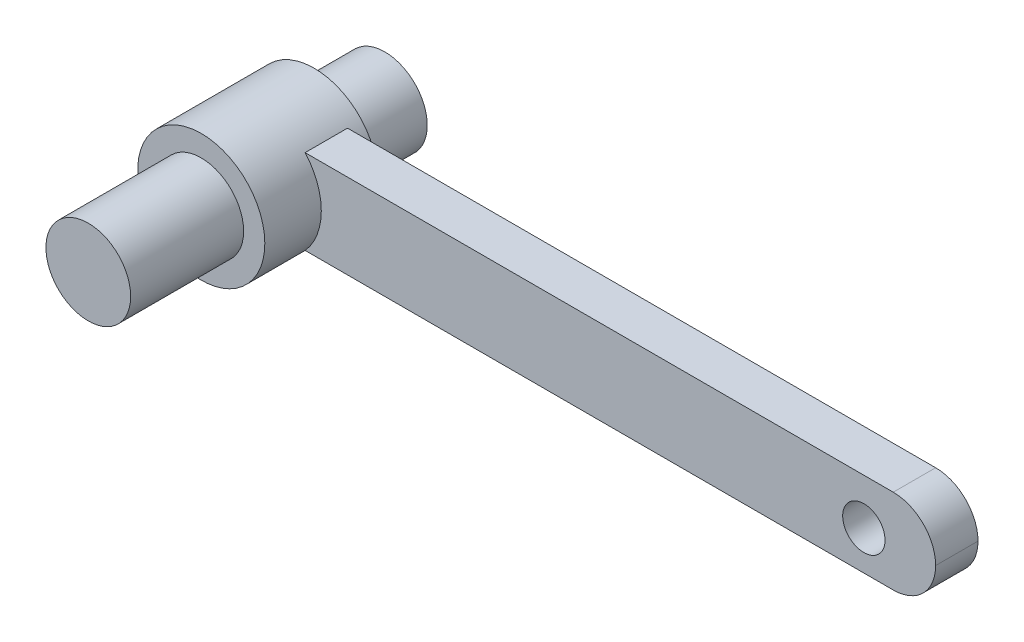
ISO-10303-21;
HEADER;
FILE_DESCRIPTION(('STEP AP214'),'2;1');
FILE_NAME('part.step','',(''),(''),'','','');
FILE_SCHEMA(('AUTOMOTIVE_DESIGN { 1 0 10303 214 1 1 1 1 }'));
ENDSEC;
DATA;
#1=APPLICATION_CONTEXT('core data for automotive mechanical design processes');
#2=APPLICATION_PROTOCOL_DEFINITION('international standard','automotive_design',2000,#1);
#3=PRODUCT_CONTEXT('',#1,'mechanical');
#4=PRODUCT('Part','Part','',(#3));
#5=PRODUCT_RELATED_PRODUCT_CATEGORY('part','',(#4));
#6=PRODUCT_DEFINITION_FORMATION('','',#4);
#7=PRODUCT_DEFINITION_CONTEXT('part definition',#1,'design');
#8=PRODUCT_DEFINITION('design','',#6,#7);
#9=PRODUCT_DEFINITION_SHAPE('','',#8);
#10=(LENGTH_UNIT() NAMED_UNIT(*) SI_UNIT(.MILLI.,.METRE.));
#11=(NAMED_UNIT(*) PLANE_ANGLE_UNIT() SI_UNIT($,.RADIAN.));
#12=(NAMED_UNIT(*) SI_UNIT($,.STERADIAN.) SOLID_ANGLE_UNIT());
#13=UNCERTAINTY_MEASURE_WITH_UNIT(LENGTH_MEASURE(1.E-05),#10,'distance_accuracy_value','');
#14=(GEOMETRIC_REPRESENTATION_CONTEXT(3) GLOBAL_UNCERTAINTY_ASSIGNED_CONTEXT((#13)) GLOBAL_UNIT_ASSIGNED_CONTEXT((#10,
#11,#12)) REPRESENTATION_CONTEXT('',''));
#15=CARTESIAN_POINT('',(0.,0.,0.));
#16=DIRECTION('',(0.,0.,1.));
#17=DIRECTION('',(1.,0.,0.));
#18=AXIS2_PLACEMENT_3D('',#15,#16,#17);
#19=CARTESIAN_POINT('',(-10.5,-0.5,0.8));
#20=DIRECTION('',(0.,0.,1.));
#21=DIRECTION('',(1.,0.,0.));
#22=AXIS2_PLACEMENT_3D('',#19,#20,#21);
#23=PLANE('',#22);
#24=CARTESIAN_POINT('',(-10.5,-0.5,0.8));
#25=DIRECTION('',(0.,0.,1.));
#26=DIRECTION('',(1.,0.,0.));
#27=AXIS2_PLACEMENT_3D('',#24,#25,#26);
#28=CIRCLE('',#27,0.45);
#29=CARTESIAN_POINT('',(-10.05,-0.5,0.8));
#30=VERTEX_POINT('',#29);
#31=EDGE_CURVE('E108',#30,#30,#28,.T.);
#32=ORIENTED_EDGE('',*,*,#31,.T.);
#33=EDGE_LOOP('',(#32));
#34=FACE_BOUND('',#33,.T.);
#35=CARTESIAN_POINT('',(-10.5,-0.5,0.8));
#36=DIRECTION('',(0.,0.,1.));
#37=DIRECTION('',(1.,0.,0.));
#38=AXIS2_PLACEMENT_3D('',#35,#36,#37);
#39=CIRCLE('',#38,0.3);
#40=CARTESIAN_POINT('',(-10.2,-0.5,0.8));
#41=VERTEX_POINT('',#40);
#42=EDGE_CURVE('E144',#41,#41,#39,.T.);
#43=ORIENTED_EDGE('',*,*,#42,.F.);
#44=EDGE_LOOP('',(#43));
#45=FACE_BOUND('',#44,.T.);
#46=ADVANCED_FACE('F31',(#34,#45),#23,.T.);
#47=CARTESIAN_POINT('',(-10.5,-0.5,0.));
#48=DIRECTION('',(0.,0.,1.));
#49=DIRECTION('',(1.,0.,0.));
#50=AXIS2_PLACEMENT_3D('',#47,#48,#49);
#51=PLANE('',#50);
#52=CARTESIAN_POINT('',(-10.5,-0.5,0.));
#53=DIRECTION('',(0.,0.,1.));
#54=DIRECTION('',(1.,0.,0.));
#55=AXIS2_PLACEMENT_3D('',#52,#53,#54);
#56=CIRCLE('',#55,0.45);
#57=CARTESIAN_POINT('',(-10.05,-0.5,0.));
#58=VERTEX_POINT('',#57);
#59=EDGE_CURVE('E147',#58,#58,#56,.T.);
#60=ORIENTED_EDGE('',*,*,#59,.F.);
#61=EDGE_LOOP('',(#60));
#62=FACE_BOUND('',#61,.T.);
#63=CARTESIAN_POINT('',(-10.5,-0.5,0.));
#64=DIRECTION('',(0.,0.,1.));
#65=DIRECTION('',(1.,0.,0.));
#66=AXIS2_PLACEMENT_3D('',#63,#64,#65);
#67=CIRCLE('',#66,0.3);
#68=CARTESIAN_POINT('',(-10.2,-0.5,0.));
#69=VERTEX_POINT('',#68);
#70=EDGE_CURVE('E126',#69,#69,#67,.T.);
#71=ORIENTED_EDGE('',*,*,#70,.T.);
#72=EDGE_LOOP('',(#71));
#73=FACE_BOUND('',#72,.T.);
#74=ADVANCED_FACE('F153',(#62,#73),#51,.F.);
#75=CARTESIAN_POINT('',(-10.5,-0.5,0.8));
#76=DIRECTION('',(0.,0.,-1.));
#77=DIRECTION('',(-1.,0.,0.));
#78=AXIS2_PLACEMENT_3D('',#75,#76,#77);
#79=CYLINDRICAL_SURFACE('',#78,0.45);
#80=CARTESIAN_POINT('',(-10.5,-0.5,0.0999999999999578));
#81=DIRECTION('',(0.,0.,-1.));
#82=DIRECTION('',(0.,1.,0.));
#83=AXIS2_PLACEMENT_3D('',#80,#81,#82);
#84=CIRCLE('',#83,0.45);
#85=CARTESIAN_POINT('',(-10.164589803375,-0.200000000000002,0.0999999999999578));
#86=VERTEX_POINT('',#85);
#87=CARTESIAN_POINT('',(-10.164589803375,-0.799999999999999,0.0999999999999578));
#88=VERTEX_POINT('',#87);
#89=EDGE_CURVE('E98',#86,#88,#84,.T.);
#90=ORIENTED_EDGE('',*,*,#89,.T.);
#91=DIRECTION('',(0.,0.,-1.));
#92=VECTOR('',#91,1.);
#93=CARTESIAN_POINT('',(-10.164589803375,-0.799999999999999,0.8));
#94=LINE('',#93,#92);
#95=CARTESIAN_POINT('',(-10.164589803375,-0.8,0.399999999999958));
#96=VERTEX_POINT('',#95);
#97=EDGE_CURVE('E84',#88,#96,#94,.F.);
#98=ORIENTED_EDGE('',*,*,#97,.T.);
#99=CARTESIAN_POINT('',(-10.5,-0.5,0.399999999999958));
#100=DIRECTION('',(0.,0.,1.));
#101=DIRECTION('',(0.,-1.,0.));
#102=AXIS2_PLACEMENT_3D('',#99,#100,#101);
#103=CIRCLE('',#102,0.45);
#104=CARTESIAN_POINT('',(-10.164589803375,-0.200000000000001,0.399999999999958));
#105=VERTEX_POINT('',#104);
#106=EDGE_CURVE('E93',#96,#105,#103,.T.);
#107=ORIENTED_EDGE('',*,*,#106,.T.);
#108=DIRECTION('',(0.,0.,-1.));
#109=VECTOR('',#108,1.);
#110=CARTESIAN_POINT('',(-10.164589803375,-0.199999999999999,0.8));
#111=LINE('',#110,#109);
#112=EDGE_CURVE('E104',#105,#86,#111,.T.);
#113=ORIENTED_EDGE('',*,*,#112,.T.);
#114=EDGE_LOOP('',(#90,#98,#107,#113));
#115=FACE_BOUND('',#114,.T.);
#116=ORIENTED_EDGE('',*,*,#31,.F.);
#117=EDGE_LOOP('',(#116));
#118=FACE_BOUND('',#117,.T.);
#119=ORIENTED_EDGE('',*,*,#59,.T.);
#120=EDGE_LOOP('',(#119));
#121=FACE_BOUND('',#120,.T.);
#122=ADVANCED_FACE('F101',(#115,#118,#121),#79,.T.);
#123=CARTESIAN_POINT('',(-5.69999999999998,-0.799999999999999,-0.413197170165134));
#124=DIRECTION('',(0.,-1.,0.));
#125=DIRECTION('',(0.,0.,-1.));
#126=AXIS2_PLACEMENT_3D('',#123,#124,#125);
#127=PLANE('',#126);
#128=DIRECTION('',(-1.,0.,0.));
#129=VECTOR('',#128,1.);
#130=CARTESIAN_POINT('',(-5.69999999999993,-0.799999999999999,0.0999999999999578));
#131=LINE('',#130,#129);
#132=CARTESIAN_POINT('',(-5.99999999999993,-0.799999999999999,0.0999999999999578));
#133=VERTEX_POINT('',#132);
#134=EDGE_CURVE('E99',#133,#88,#131,.T.);
#135=ORIENTED_EDGE('',*,*,#134,.F.);
#136=DIRECTION('',(0.,0.,1.));
#137=VECTOR('',#136,1.);
#138=CARTESIAN_POINT('',(-5.99999999999993,-0.799999999999999,-0.413197170165134));
#139=LINE('',#138,#137);
#140=CARTESIAN_POINT('',(-5.99999999999993,-0.8,0.399999999999958));
#141=VERTEX_POINT('',#140);
#142=EDGE_CURVE('E87',#133,#141,#139,.T.);
#143=ORIENTED_EDGE('',*,*,#142,.T.);
#144=DIRECTION('',(-1.,0.,0.));
#145=VECTOR('',#144,1.);
#146=CARTESIAN_POINT('',(-5.7,-0.8,0.399999999999958));
#147=LINE('',#146,#145);
#148=EDGE_CURVE('E79',#141,#96,#147,.T.);
#149=ORIENTED_EDGE('',*,*,#148,.T.);
#150=ORIENTED_EDGE('',*,*,#97,.F.);
#151=EDGE_LOOP('',(#135,#143,#149,#150));
#152=FACE_BOUND('',#151,.T.);
#153=ADVANCED_FACE('F82',(#152),#127,.T.);
#154=CARTESIAN_POINT('',(-5.69999999999993,-0.199999999999999,-0.413197170165134));
#155=DIRECTION('',(0.,1.,0.));
#156=DIRECTION('',(0.,0.,1.));
#157=AXIS2_PLACEMENT_3D('',#154,#155,#156);
#158=PLANE('',#157);
#159=DIRECTION('',(-1.,0.,0.));
#160=VECTOR('',#159,1.);
#161=CARTESIAN_POINT('',(-5.7,-0.200000000000001,0.399999999999958));
#162=LINE('',#161,#160);
#163=CARTESIAN_POINT('',(-5.99999999999993,-0.200000000000001,0.399999999999958));
#164=VERTEX_POINT('',#163);
#165=EDGE_CURVE('E89',#164,#105,#162,.T.);
#166=ORIENTED_EDGE('',*,*,#165,.F.);
#167=DIRECTION('',(0.,0.,-1.));
#168=VECTOR('',#167,1.);
#169=CARTESIAN_POINT('',(-5.99999999999993,-0.199999999999999,-0.413197170165134));
#170=LINE('',#169,#168);
#171=CARTESIAN_POINT('',(-5.99999999999993,-0.200000000000002,0.0999999999999578));
#172=VERTEX_POINT('',#171);
#173=EDGE_CURVE('E11',#164,#172,#170,.T.);
#174=ORIENTED_EDGE('',*,*,#173,.T.);
#175=DIRECTION('',(-1.,0.,0.));
#176=VECTOR('',#175,1.);
#177=CARTESIAN_POINT('',(-5.6999999999999,-0.200000000000002,0.0999999999999578));
#178=LINE('',#177,#176);
#179=EDGE_CURVE('E120',#172,#86,#178,.T.);
#180=ORIENTED_EDGE('',*,*,#179,.T.);
#181=ORIENTED_EDGE('',*,*,#112,.F.);
#182=EDGE_LOOP('',(#166,#174,#180,#181));
#183=FACE_BOUND('',#182,.T.);
#184=ADVANCED_FACE('F188',(#183),#158,.T.);
#185=CARTESIAN_POINT('',(-5.69999999999992,-0.499999999999999,0.0999999999999578));
#186=DIRECTION('',(0.,0.,-1.));
#187=DIRECTION('',(0.,1.,0.));
#188=AXIS2_PLACEMENT_3D('',#185,#186,#187);
#189=PLANE('',#188);
#190=CARTESIAN_POINT('',(-6.2082255628475,-0.524292893526734,0.0999999999999578));
#191=DIRECTION('',(0.,0.,-1.));
#192=DIRECTION('',(0.,1.,0.));
#193=AXIS2_PLACEMENT_3D('',#190,#191,#192);
#194=CIRCLE('',#193,0.15);
#195=CARTESIAN_POINT('',(-6.2082255628475,-0.374292893526734,0.0999999999999578));
#196=VERTEX_POINT('',#195);
#197=EDGE_CURVE('E90',#196,#196,#194,.T.);
#198=ORIENTED_EDGE('',*,*,#197,.F.);
#199=EDGE_LOOP('',(#198));
#200=FACE_BOUND('',#199,.T.);
#201=CARTESIAN_POINT('',(-5.99999999999993,-0.499999999999999,0.0999999999999578));
#202=DIRECTION('',(0.,0.,-1.));
#203=DIRECTION('',(0.,1.,0.));
#204=AXIS2_PLACEMENT_3D('',#201,#202,#203);
#205=CIRCLE('',#204,0.3);
#206=CARTESIAN_POINT('',(-5.69999999999992,-0.499999999999999,0.0999999999999578));
#207=VERTEX_POINT('',#206);
#208=EDGE_CURVE('E47',#172,#207,#205,.T.);
#209=ORIENTED_EDGE('',*,*,#208,.T.);
#210=CARTESIAN_POINT('',(-5.99999999999993,-0.5,0.0999999999999578));
#211=DIRECTION('',(0.,0.,-1.));
#212=DIRECTION('',(0.,1.,0.));
#213=AXIS2_PLACEMENT_3D('',#210,#211,#212);
#214=CIRCLE('',#213,0.3);
#215=EDGE_CURVE('E40',#207,#133,#214,.T.);
#216=ORIENTED_EDGE('',*,*,#215,.T.);
#217=ORIENTED_EDGE('',*,*,#134,.T.);
#218=ORIENTED_EDGE('',*,*,#89,.F.);
#219=ORIENTED_EDGE('',*,*,#179,.F.);
#220=EDGE_LOOP('',(#209,#216,#217,#218,#219));
#221=FACE_BOUND('',#220,.T.);
#222=ADVANCED_FACE('F117',(#200,#221),#189,.T.);
#223=CARTESIAN_POINT('',(-5.69999999999993,-0.5,0.399999999999958));
#224=DIRECTION('',(0.,0.,1.));
#225=DIRECTION('',(0.,-1.,0.));
#226=AXIS2_PLACEMENT_3D('',#223,#224,#225);
#227=PLANE('',#226);
#228=CARTESIAN_POINT('',(-6.2082255628475,-0.524292893526734,0.399999999999958));
#229=DIRECTION('',(0.,0.,1.));
#230=DIRECTION('',(1.,0.,0.));
#231=AXIS2_PLACEMENT_3D('',#228,#229,#230);
#232=CIRCLE('',#231,0.15);
#233=CARTESIAN_POINT('',(-6.0582255628475,-0.524292893526734,0.399999999999958));
#234=VERTEX_POINT('',#233);
#235=EDGE_CURVE('E125',#234,#234,#232,.T.);
#236=ORIENTED_EDGE('',*,*,#235,.F.);
#237=EDGE_LOOP('',(#236));
#238=FACE_BOUND('',#237,.T.);
#239=ORIENTED_EDGE('',*,*,#148,.F.);
#240=CARTESIAN_POINT('',(-5.99999999999993,-0.5,0.399999999999958));
#241=DIRECTION('',(0.,0.,1.));
#242=DIRECTION('',(0.,-1.,0.));
#243=AXIS2_PLACEMENT_3D('',#240,#241,#242);
#244=CIRCLE('',#243,0.3);
#245=CARTESIAN_POINT('',(-5.69999999999993,-0.499999999999999,0.399999999999958));
#246=VERTEX_POINT('',#245);
#247=EDGE_CURVE('E113',#141,#246,#244,.T.);
#248=ORIENTED_EDGE('',*,*,#247,.T.);
#249=CARTESIAN_POINT('',(-5.99999999999993,-0.499999999999999,0.399999999999958));
#250=DIRECTION('',(0.,0.,1.));
#251=DIRECTION('',(0.,-1.,0.));
#252=AXIS2_PLACEMENT_3D('',#249,#250,#251);
#253=CIRCLE('',#252,0.3);
#254=EDGE_CURVE('E106',#246,#164,#253,.T.);
#255=ORIENTED_EDGE('',*,*,#254,.T.);
#256=ORIENTED_EDGE('',*,*,#165,.T.);
#257=ORIENTED_EDGE('',*,*,#106,.F.);
#258=EDGE_LOOP('',(#239,#248,#255,#256,#257));
#259=FACE_BOUND('',#258,.T.);
#260=ADVANCED_FACE('F94',(#238,#259),#227,.T.);
#261=CARTESIAN_POINT('',(-6.2082255628475,-0.524292893526734,-4.10000000000004));
#262=DIRECTION('',(0.,0.,1.));
#263=DIRECTION('',(1.,0.,0.));
#264=AXIS2_PLACEMENT_3D('',#261,#262,#263);
#265=CYLINDRICAL_SURFACE('',#264,0.15);
#266=ORIENTED_EDGE('',*,*,#197,.T.);
#267=EDGE_LOOP('',(#266));
#268=FACE_BOUND('',#267,.T.);
#269=ORIENTED_EDGE('',*,*,#235,.T.);
#270=EDGE_LOOP('',(#269));
#271=FACE_BOUND('',#270,.T.);
#272=ADVANCED_FACE('F173',(#268,#271),#265,.F.);
#273=CARTESIAN_POINT('',(-5.99999999999993,-0.499999999999999,-0.413197170165134));
#274=DIRECTION('',(0.,0.,-1.));
#275=DIRECTION('',(-1.,0.,0.));
#276=AXIS2_PLACEMENT_3D('',#273,#274,#275);
#277=CYLINDRICAL_SURFACE('',#276,0.3);
#278=DIRECTION('',(0.,0.,-1.));
#279=VECTOR('',#278,1.);
#280=CARTESIAN_POINT('',(-5.69999999999993,-0.499999999999999,-0.413197170165134));
#281=LINE('',#280,#279);
#282=EDGE_CURVE('E35',#207,#246,#281,.F.);
#283=ORIENTED_EDGE('',*,*,#282,.F.);
#284=ORIENTED_EDGE('',*,*,#208,.F.);
#285=ORIENTED_EDGE('',*,*,#173,.F.);
#286=ORIENTED_EDGE('',*,*,#254,.F.);
#287=EDGE_LOOP('',(#283,#284,#285,#286));
#288=FACE_BOUND('',#287,.T.);
#289=ADVANCED_FACE('F33',(#288),#277,.T.);
#290=CARTESIAN_POINT('',(-5.99999999999993,-0.5,-0.413197170165134));
#291=DIRECTION('',(0.,0.,1.));
#292=DIRECTION('',(1.,0.,0.));
#293=AXIS2_PLACEMENT_3D('',#290,#291,#292);
#294=CYLINDRICAL_SURFACE('',#293,0.3);
#295=ORIENTED_EDGE('',*,*,#215,.F.);
#296=ORIENTED_EDGE('',*,*,#282,.T.);
#297=ORIENTED_EDGE('',*,*,#247,.F.);
#298=ORIENTED_EDGE('',*,*,#142,.F.);
#299=EDGE_LOOP('',(#295,#296,#297,#298));
#300=FACE_BOUND('',#299,.T.);
#301=ADVANCED_FACE('F122',(#300),#294,.T.);
#302=CARTESIAN_POINT('',(-10.5,-0.5,-0.5));
#303=DIRECTION('',(0.,0.,1.));
#304=DIRECTION('',(1.,0.,0.));
#305=AXIS2_PLACEMENT_3D('',#302,#303,#304);
#306=PLANE('',#305);
#307=CARTESIAN_POINT('',(-10.5,-0.5,-0.5));
#308=DIRECTION('',(0.,0.,1.));
#309=DIRECTION('',(1.,0.,0.));
#310=AXIS2_PLACEMENT_3D('',#307,#308,#309);
#311=CIRCLE('',#310,0.3);
#312=CARTESIAN_POINT('',(-10.2,-0.5,-0.5));
#313=VERTEX_POINT('',#312);
#314=EDGE_CURVE('E130',#313,#313,#311,.T.);
#315=ORIENTED_EDGE('',*,*,#314,.F.);
#316=EDGE_LOOP('',(#315));
#317=FACE_BOUND('',#316,.T.);
#318=ADVANCED_FACE('F165',(#317),#306,.F.);
#319=CARTESIAN_POINT('',(-10.5,-0.5,-0.5));
#320=DIRECTION('',(0.,0.,1.));
#321=DIRECTION('',(1.,0.,0.));
#322=AXIS2_PLACEMENT_3D('',#319,#320,#321);
#323=CYLINDRICAL_SURFACE('',#322,0.3);
#324=ORIENTED_EDGE('',*,*,#314,.T.);
#325=EDGE_LOOP('',(#324));
#326=FACE_BOUND('',#325,.T.);
#327=ORIENTED_EDGE('',*,*,#70,.F.);
#328=EDGE_LOOP('',(#327));
#329=FACE_BOUND('',#328,.T.);
#330=ADVANCED_FACE('F170',(#326,#329),#323,.T.);
#331=ORIENTED_EDGE('',*,*,#42,.T.);
#332=EDGE_LOOP('',(#331));
#333=FACE_BOUND('',#332,.T.);
#334=CARTESIAN_POINT('',(-10.5,-0.5,1.6));
#335=DIRECTION('',(0.,0.,1.));
#336=DIRECTION('',(1.,0.,0.));
#337=AXIS2_PLACEMENT_3D('',#334,#335,#336);
#338=CIRCLE('',#337,0.3);
#339=CARTESIAN_POINT('',(-10.2,-0.5,1.6));
#340=VERTEX_POINT('',#339);
#341=EDGE_CURVE('E135',#340,#340,#338,.T.);
#342=ORIENTED_EDGE('',*,*,#341,.F.);
#343=EDGE_LOOP('',(#342));
#344=FACE_BOUND('',#343,.T.);
#345=ADVANCED_FACE('F186',(#333,#344),#323,.T.);
#346=CARTESIAN_POINT('',(-10.5,-0.5,1.6));
#347=DIRECTION('',(0.,0.,1.));
#348=DIRECTION('',(1.,0.,0.));
#349=AXIS2_PLACEMENT_3D('',#346,#347,#348);
#350=PLANE('',#349);
#351=ORIENTED_EDGE('',*,*,#341,.T.);
#352=EDGE_LOOP('',(#351));
#353=FACE_BOUND('',#352,.T.);
#354=ADVANCED_FACE('F242',(#353),#350,.T.);
#355=CLOSED_SHELL('',(#46,#74,#122,#153,#184,#222,#260,#272,#289,#301,#318,#330,#345,#354));
#356=MANIFOLD_SOLID_BREP('B2',#355);
#357=ADVANCED_BREP_SHAPE_REPRESENTATION('',(#18,#356),#14);
#358=SHAPE_DEFINITION_REPRESENTATION(#9,#357);
ENDSEC;
END-ISO-10303-21;
